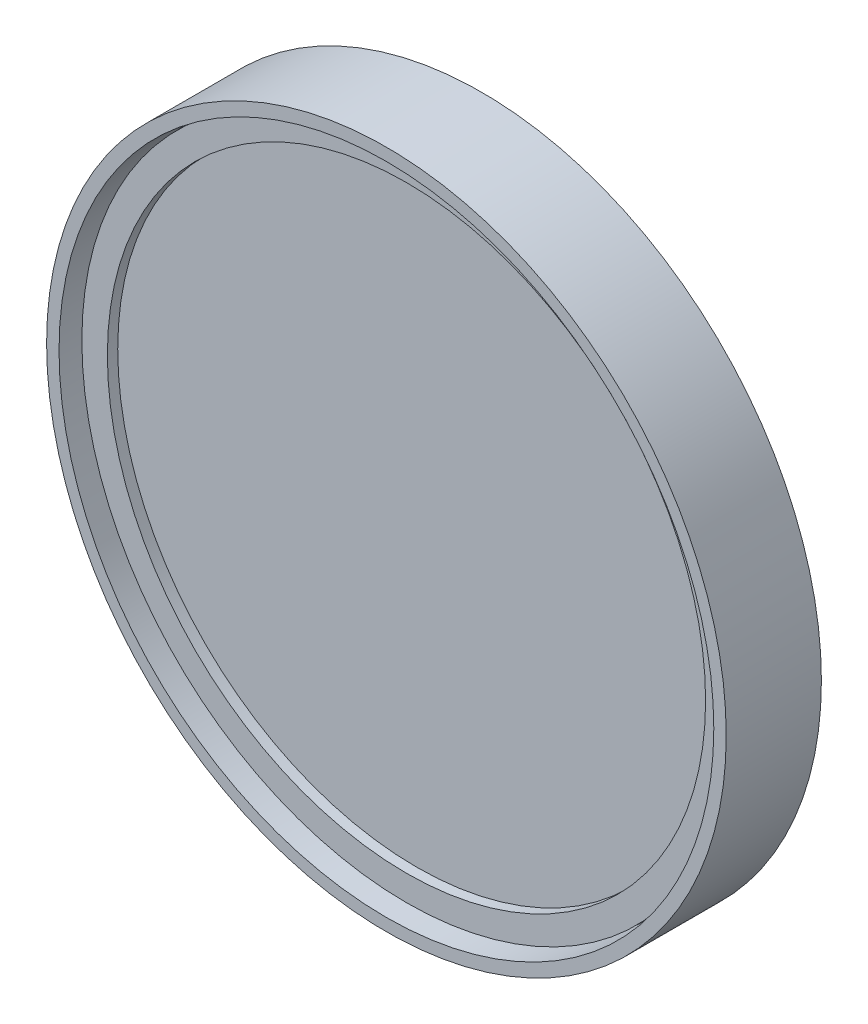
ISO-10303-21;
HEADER;
FILE_DESCRIPTION(('STEP AP214'),'2;1');
FILE_NAME('part.step','',(''),(''),'','','');
FILE_SCHEMA(('AUTOMOTIVE_DESIGN { 1 0 10303 214 1 1 1 1 }'));
ENDSEC;
DATA;
#1=APPLICATION_CONTEXT('core data for automotive mechanical design processes');
#2=APPLICATION_PROTOCOL_DEFINITION('international standard','automotive_design',2000,#1);
#3=PRODUCT_CONTEXT('',#1,'mechanical');
#4=PRODUCT('Part','Part','',(#3));
#5=PRODUCT_RELATED_PRODUCT_CATEGORY('part','',(#4));
#6=PRODUCT_DEFINITION_FORMATION('','',#4);
#7=PRODUCT_DEFINITION_CONTEXT('part definition',#1,'design');
#8=PRODUCT_DEFINITION('design','',#6,#7);
#9=PRODUCT_DEFINITION_SHAPE('','',#8);
#10=(LENGTH_UNIT() NAMED_UNIT(*) SI_UNIT(.MILLI.,.METRE.));
#11=(NAMED_UNIT(*) PLANE_ANGLE_UNIT() SI_UNIT($,.RADIAN.));
#12=(NAMED_UNIT(*) SI_UNIT($,.STERADIAN.) SOLID_ANGLE_UNIT());
#13=UNCERTAINTY_MEASURE_WITH_UNIT(LENGTH_MEASURE(1.E-05),#10,'distance_accuracy_value','');
#14=(GEOMETRIC_REPRESENTATION_CONTEXT(3) GLOBAL_UNCERTAINTY_ASSIGNED_CONTEXT((#13)) GLOBAL_UNIT_ASSIGNED_CONTEXT((#10,
#11,#12)) REPRESENTATION_CONTEXT('',''));
#15=CARTESIAN_POINT('',(0.,0.,0.));
#16=DIRECTION('',(0.,0.,1.));
#17=DIRECTION('',(1.,0.,0.));
#18=AXIS2_PLACEMENT_3D('',#15,#16,#17);
#19=CARTESIAN_POINT('',(0.,0.,2.381));
#20=DIRECTION('',(0.,0.,1.));
#21=DIRECTION('',(1.,0.,0.));
#22=AXIS2_PLACEMENT_3D('',#19,#20,#21);
#23=PLANE('',#22);
#24=CARTESIAN_POINT('',(0.,0.,2.381));
#25=DIRECTION('',(0.,0.,1.));
#26=DIRECTION('',(1.,0.,0.));
#27=AXIS2_PLACEMENT_3D('',#24,#25,#26);
#28=CIRCLE('',#27,11.95);
#29=CARTESIAN_POINT('',(11.95,0.,2.381));
#30=VERTEX_POINT('',#29);
#31=EDGE_CURVE('P0_E47',#30,#30,#28,.F.);
#32=ORIENTED_EDGE('',*,*,#31,.F.);
#33=EDGE_LOOP('',(#32));
#34=FACE_BOUND('',#33,.T.);
#35=ADVANCED_FACE('P0_F44',(#34),#23,.T.);
#36=CARTESIAN_POINT('',(0.,0.,0.381000000000001));
#37=DIRECTION('',(0.,0.,1.));
#38=DIRECTION('',(1.,0.,0.));
#39=AXIS2_PLACEMENT_3D('',#36,#37,#38);
#40=CYLINDRICAL_SURFACE('',#39,11.95);
#41=ORIENTED_EDGE('',*,*,#31,.T.);
#42=EDGE_LOOP('',(#41));
#43=FACE_BOUND('',#42,.T.);
#44=CARTESIAN_POINT('',(0.,0.,0.381000000000001));
#45=DIRECTION('',(0.,0.,1.));
#46=DIRECTION('',(1.,0.,0.));
#47=AXIS2_PLACEMENT_3D('',#44,#45,#46);
#48=CIRCLE('',#47,11.95);
#49=CARTESIAN_POINT('',(11.95,0.,0.381000000000001));
#50=VERTEX_POINT('',#49);
#51=EDGE_CURVE('P0_E11',#50,#50,#48,.T.);
#52=ORIENTED_EDGE('',*,*,#51,.T.);
#53=EDGE_LOOP('',(#52));
#54=FACE_BOUND('',#53,.T.);
#55=ADVANCED_FACE('P0_F73',(#43,#54),#40,.T.);
#56=CARTESIAN_POINT('',(0.,0.,0.381000000000001));
#57=DIRECTION('',(0.,0.,1.));
#58=DIRECTION('',(1.,0.,0.));
#59=AXIS2_PLACEMENT_3D('',#56,#57,#58);
#60=PLANE('',#59);
#61=CARTESIAN_POINT('',(0.,0.,0.381000000000001));
#62=DIRECTION('',(0.,0.,-1.));
#63=DIRECTION('',(-1.,0.,0.));
#64=AXIS2_PLACEMENT_3D('',#61,#62,#63);
#65=CIRCLE('',#64,11.);
#66=CARTESIAN_POINT('',(-11.,0.,0.381000000000001));
#67=VERTEX_POINT('',#66);
#68=EDGE_CURVE('P0_E56',#67,#67,#65,.T.);
#69=ORIENTED_EDGE('',*,*,#68,.F.);
#70=EDGE_LOOP('',(#69));
#71=FACE_BOUND('',#70,.T.);
#72=ORIENTED_EDGE('',*,*,#51,.F.);
#73=EDGE_LOOP('',(#72));
#74=FACE_BOUND('',#73,.T.);
#75=ADVANCED_FACE('P0_F67',(#71,#74),#60,.F.);
#76=CARTESIAN_POINT('',(0.,0.,0.761000000000001));
#77=DIRECTION('',(0.,0.,-1.));
#78=DIRECTION('',(-1.,0.,0.));
#79=AXIS2_PLACEMENT_3D('',#76,#77,#78);
#80=CYLINDRICAL_SURFACE('',#79,11.);
#81=CARTESIAN_POINT('',(0.,0.,0.761000000000001));
#82=DIRECTION('',(0.,0.,-1.));
#83=DIRECTION('',(-1.,0.,0.));
#84=AXIS2_PLACEMENT_3D('',#81,#82,#83);
#85=CIRCLE('',#84,11.);
#86=CARTESIAN_POINT('',(-11.,0.,0.761000000000001));
#87=VERTEX_POINT('',#86);
#88=EDGE_CURVE('P0_E54',#87,#87,#85,.T.);
#89=ORIENTED_EDGE('',*,*,#88,.F.);
#90=EDGE_LOOP('',(#89));
#91=FACE_BOUND('',#90,.T.);
#92=ORIENTED_EDGE('',*,*,#68,.T.);
#93=EDGE_LOOP('',(#92));
#94=FACE_BOUND('',#93,.T.);
#95=ADVANCED_FACE('P0_F64',(#91,#94),#80,.F.);
#96=CARTESIAN_POINT('',(0.,0.,0.761000000000001));
#97=DIRECTION('',(0.,0.,-1.));
#98=DIRECTION('',(-1.,0.,0.));
#99=AXIS2_PLACEMENT_3D('',#96,#97,#98);
#100=PLANE('',#99);
#101=ORIENTED_EDGE('',*,*,#88,.T.);
#102=EDGE_LOOP('',(#101));
#103=FACE_BOUND('',#102,.T.);
#104=ADVANCED_FACE('P0_F62',(#103),#100,.T.);
#105=CLOSED_SHELL('',(#35,#55,#75,#95,#104));
#106=MANIFOLD_SOLID_BREP('P0_B2',#105);
#107=CARTESIAN_POINT('',(0.,0.,2.762));
#108=DIRECTION('',(0.,0.,1.));
#109=DIRECTION('',(1.,0.,0.));
#110=AXIS2_PLACEMENT_3D('',#107,#108,#109);
#111=PLANE('',#110);
#112=CARTESIAN_POINT('',(0.,0.,2.762));
#113=DIRECTION('',(0.,0.,1.));
#114=DIRECTION('',(1.,0.,0.));
#115=AXIS2_PLACEMENT_3D('',#112,#113,#114);
#116=CIRCLE('',#115,11.);
#117=CARTESIAN_POINT('',(11.,0.,2.762));
#118=VERTEX_POINT('',#117);
#119=EDGE_CURVE('P0_E129',#118,#118,#116,.T.);
#120=ORIENTED_EDGE('',*,*,#119,.F.);
#121=EDGE_LOOP('',(#120));
#122=FACE_BOUND('',#121,.T.);
#123=CARTESIAN_POINT('',(0.,0.,2.762));
#124=DIRECTION('',(0.,0.,1.));
#125=DIRECTION('',(1.,0.,0.));
#126=AXIS2_PLACEMENT_3D('',#123,#124,#125);
#127=CIRCLE('',#126,11.938);
#128=CARTESIAN_POINT('',(11.938,0.,2.762));
#129=VERTEX_POINT('',#128);
#130=EDGE_CURVE('P0_E118',#129,#129,#127,.F.);
#131=ORIENTED_EDGE('',*,*,#130,.F.);
#132=EDGE_LOOP('',(#131));
#133=FACE_BOUND('',#132,.T.);
#134=ADVANCED_FACE('P0_F115',(#122,#133),#111,.T.);
#135=CARTESIAN_POINT('',(0.,0.,2.381));
#136=DIRECTION('',(0.,0.,1.));
#137=DIRECTION('',(1.,0.,0.));
#138=AXIS2_PLACEMENT_3D('',#135,#136,#137);
#139=CYLINDRICAL_SURFACE('',#138,11.938);
#140=ORIENTED_EDGE('',*,*,#130,.T.);
#141=EDGE_LOOP('',(#140));
#142=FACE_BOUND('',#141,.T.);
#143=CARTESIAN_POINT('',(0.,0.,2.381));
#144=DIRECTION('',(0.,0.,1.));
#145=DIRECTION('',(1.,0.,0.));
#146=AXIS2_PLACEMENT_3D('',#143,#144,#145);
#147=CIRCLE('',#146,11.938);
#148=CARTESIAN_POINT('',(11.938,0.,2.381));
#149=VERTEX_POINT('',#148);
#150=EDGE_CURVE('P0_E43',#149,#149,#147,.T.);
#151=ORIENTED_EDGE('',*,*,#150,.T.);
#152=EDGE_LOOP('',(#151));
#153=FACE_BOUND('',#152,.T.);
#154=ADVANCED_FACE('P0_F137',(#142,#153),#139,.T.);
#155=CARTESIAN_POINT('',(0.,0.,2.381));
#156=DIRECTION('',(0.,0.,1.));
#157=DIRECTION('',(1.,0.,0.));
#158=AXIS2_PLACEMENT_3D('',#155,#156,#157);
#159=PLANE('',#158);
#160=CARTESIAN_POINT('',(0.,0.,2.381));
#161=DIRECTION('',(0.,0.,1.));
#162=DIRECTION('',(1.,0.,0.));
#163=AXIS2_PLACEMENT_3D('',#160,#161,#162);
#164=CIRCLE('',#163,11.);
#165=CARTESIAN_POINT('',(11.,0.,2.381));
#166=VERTEX_POINT('',#165);
#167=EDGE_CURVE('P0_E125',#166,#166,#164,.F.);
#168=ORIENTED_EDGE('',*,*,#167,.F.);
#169=EDGE_LOOP('',(#168));
#170=FACE_BOUND('',#169,.T.);
#171=ORIENTED_EDGE('',*,*,#150,.F.);
#172=EDGE_LOOP('',(#171));
#173=FACE_BOUND('',#172,.T.);
#174=ADVANCED_FACE('P0_F141',(#170,#173),#159,.F.);
#175=CARTESIAN_POINT('',(0.,0.,-28.7316983722081));
#176=DIRECTION('',(0.,0.,1.));
#177=DIRECTION('',(1.,0.,0.));
#178=AXIS2_PLACEMENT_3D('',#175,#176,#177);
#179=CYLINDRICAL_SURFACE('',#178,11.);
#180=ORIENTED_EDGE('',*,*,#167,.T.);
#181=EDGE_LOOP('',(#180));
#182=FACE_BOUND('',#181,.T.);
#183=ORIENTED_EDGE('',*,*,#119,.T.);
#184=EDGE_LOOP('',(#183));
#185=FACE_BOUND('',#184,.T.);
#186=ADVANCED_FACE('P0_F133',(#182,#185),#179,.F.);
#187=CLOSED_SHELL('',(#134,#154,#174,#186));
#188=MANIFOLD_SOLID_BREP('P0_B6',#187);
#189=CARTESIAN_POINT('',(0.,0.,0.));
#190=DIRECTION('',(0.,0.,1.));
#191=DIRECTION('',(1.,0.,0.));
#192=AXIS2_PLACEMENT_3D('',#189,#190,#191);
#193=CYLINDRICAL_SURFACE('',#192,12.1031);
#194=CARTESIAN_POINT('',(0.,0.,0.6858));
#195=DIRECTION('',(0.,0.,1.));
#196=DIRECTION('',(1.,0.,0.));
#197=AXIS2_PLACEMENT_3D('',#194,#195,#196);
#198=CIRCLE('',#197,12.1031);
#199=CARTESIAN_POINT('',(12.1031,0.,0.6858));
#200=VERTEX_POINT('',#199);
#201=EDGE_CURVE('P1_E17',#200,#200,#198,.F.);
#202=ORIENTED_EDGE('',*,*,#201,.F.);
#203=EDGE_LOOP('',(#202));
#204=FACE_BOUND('',#203,.T.);
#205=CARTESIAN_POINT('',(0.,0.,0.381));
#206=DIRECTION('',(0.,0.,1.));
#207=DIRECTION('',(1.,0.,0.));
#208=AXIS2_PLACEMENT_3D('',#205,#206,#207);
#209=CIRCLE('',#208,12.1031);
#210=CARTESIAN_POINT('',(12.1031,0.,0.381));
#211=VERTEX_POINT('',#210);
#212=EDGE_CURVE('P1_E39',#211,#211,#209,.T.);
#213=ORIENTED_EDGE('',*,*,#212,.F.);
#214=EDGE_LOOP('',(#213));
#215=FACE_BOUND('',#214,.T.);
#216=ADVANCED_FACE('P1_F14',(#204,#215),#193,.F.);
#217=CARTESIAN_POINT('',(0.,12.0396,0.6858));
#218=DIRECTION('',(0.,0.,-1.));
#219=DIRECTION('',(-1.,0.,0.));
#220=AXIS2_PLACEMENT_3D('',#217,#218,#219);
#221=PLANE('',#220);
#222=ORIENTED_EDGE('',*,*,#201,.T.);
#223=EDGE_LOOP('',(#222));
#224=FACE_BOUND('',#223,.T.);
#225=CARTESIAN_POINT('',(0.,0.,0.6858));
#226=DIRECTION('',(0.,0.,-1.));
#227=DIRECTION('',(-1.,0.,0.));
#228=AXIS2_PLACEMENT_3D('',#225,#226,#227);
#229=CIRCLE('',#228,12.0396);
#230=CARTESIAN_POINT('',(-12.0396,0.,0.6858));
#231=VERTEX_POINT('',#230);
#232=EDGE_CURVE('P1_E37',#231,#231,#229,.F.);
#233=ORIENTED_EDGE('',*,*,#232,.T.);
#234=EDGE_LOOP('',(#233));
#235=FACE_BOUND('',#234,.T.);
#236=ADVANCED_FACE('P1_F46',(#224,#235),#221,.T.);
#237=CARTESIAN_POINT('',(0.,10.6045,0.381));
#238=DIRECTION('',(0.,0.,1.));
#239=DIRECTION('',(1.,0.,0.));
#240=AXIS2_PLACEMENT_3D('',#237,#238,#239);
#241=PLANE('',#240);
#242=ORIENTED_EDGE('',*,*,#212,.T.);
#243=EDGE_LOOP('',(#242));
#244=FACE_BOUND('',#243,.T.);
#245=CARTESIAN_POINT('',(0.,0.,0.381));
#246=DIRECTION('',(0.,0.,-1.));
#247=DIRECTION('',(-1.,0.,0.));
#248=AXIS2_PLACEMENT_3D('',#245,#246,#247);
#249=CIRCLE('',#248,10.6045);
#250=CARTESIAN_POINT('',(-10.6045,0.,0.381));
#251=VERTEX_POINT('',#250);
#252=EDGE_CURVE('P1_E34',#251,#251,#249,.T.);
#253=ORIENTED_EDGE('',*,*,#252,.T.);
#254=EDGE_LOOP('',(#253));
#255=FACE_BOUND('',#254,.T.);
#256=ADVANCED_FACE('P1_F55',(#244,#255),#241,.T.);
#257=CARTESIAN_POINT('',(0.,0.,0.));
#258=DIRECTION('',(0.,0.,-1.));
#259=DIRECTION('',(-1.,0.,0.));
#260=AXIS2_PLACEMENT_3D('',#257,#258,#259);
#261=CYLINDRICAL_SURFACE('',#260,12.0396);
#262=ORIENTED_EDGE('',*,*,#232,.F.);
#263=EDGE_LOOP('',(#262));
#264=FACE_BOUND('',#263,.T.);
#265=CARTESIAN_POINT('',(0.,0.,3.5));
#266=DIRECTION('',(0.,0.,-1.));
#267=DIRECTION('',(-1.,0.,0.));
#268=AXIS2_PLACEMENT_3D('',#265,#266,#267);
#269=CIRCLE('',#268,12.0396);
#270=CARTESIAN_POINT('',(-12.0396,0.,3.5));
#271=VERTEX_POINT('',#270);
#272=EDGE_CURVE('P1_E31',#271,#271,#269,.T.);
#273=ORIENTED_EDGE('',*,*,#272,.F.);
#274=EDGE_LOOP('',(#273));
#275=FACE_BOUND('',#274,.T.);
#276=ADVANCED_FACE('P1_F74',(#264,#275),#261,.F.);
#277=CARTESIAN_POINT('',(0.,0.,0.));
#278=DIRECTION('',(0.,0.,-1.));
#279=DIRECTION('',(-1.,0.,0.));
#280=AXIS2_PLACEMENT_3D('',#277,#278,#279);
#281=CYLINDRICAL_SURFACE('',#280,10.6045);
#282=CARTESIAN_POINT('',(0.,0.,0.));
#283=DIRECTION('',(0.,0.,-1.));
#284=DIRECTION('',(-1.,0.,0.));
#285=AXIS2_PLACEMENT_3D('',#282,#283,#284);
#286=CIRCLE('',#285,10.6045);
#287=CARTESIAN_POINT('',(-10.6045,0.,0.));
#288=VERTEX_POINT('',#287);
#289=EDGE_CURVE('P1_E26',#288,#288,#286,.F.);
#290=ORIENTED_EDGE('',*,*,#289,.F.);
#291=EDGE_LOOP('',(#290));
#292=FACE_BOUND('',#291,.T.);
#293=ORIENTED_EDGE('',*,*,#252,.F.);
#294=EDGE_LOOP('',(#293));
#295=FACE_BOUND('',#294,.T.);
#296=ADVANCED_FACE('P1_F70',(#292,#295),#281,.F.);
#297=CARTESIAN_POINT('',(0.,12.0396,3.5));
#298=DIRECTION('',(0.,0.,1.));
#299=DIRECTION('',(1.,0.,0.));
#300=AXIS2_PLACEMENT_3D('',#297,#298,#299);
#301=PLANE('',#300);
#302=CARTESIAN_POINT('',(0.,0.,3.5));
#303=DIRECTION('',(0.,0.,-1.));
#304=DIRECTION('',(-1.,0.,0.));
#305=AXIS2_PLACEMENT_3D('',#302,#303,#304);
#306=CIRCLE('',#305,12.4968);
#307=CARTESIAN_POINT('',(-12.4968,0.,3.5));
#308=VERTEX_POINT('',#307);
#309=EDGE_CURVE('P1_E21',#308,#308,#306,.T.);
#310=ORIENTED_EDGE('',*,*,#309,.F.);
#311=EDGE_LOOP('',(#310));
#312=FACE_BOUND('',#311,.T.);
#313=ORIENTED_EDGE('',*,*,#272,.T.);
#314=EDGE_LOOP('',(#313));
#315=FACE_BOUND('',#314,.T.);
#316=ADVANCED_FACE('P1_F63',(#312,#315),#301,.T.);
#317=CARTESIAN_POINT('',(0.,10.6045,0.));
#318=DIRECTION('',(0.,0.,-1.));
#319=DIRECTION('',(-1.,0.,0.));
#320=AXIS2_PLACEMENT_3D('',#317,#318,#319);
#321=PLANE('',#320);
#322=ORIENTED_EDGE('',*,*,#289,.T.);
#323=EDGE_LOOP('',(#322));
#324=FACE_BOUND('',#323,.T.);
#325=CARTESIAN_POINT('',(0.,0.,0.));
#326=DIRECTION('',(0.,0.,-1.));
#327=DIRECTION('',(-1.,0.,0.));
#328=AXIS2_PLACEMENT_3D('',#325,#326,#327);
#329=CIRCLE('',#328,12.4968);
#330=CARTESIAN_POINT('',(-12.4968,0.,0.));
#331=VERTEX_POINT('',#330);
#332=EDGE_CURVE('P1_E10',#331,#331,#329,.F.);
#333=ORIENTED_EDGE('',*,*,#332,.F.);
#334=EDGE_LOOP('',(#333));
#335=FACE_BOUND('',#334,.T.);
#336=ADVANCED_FACE('P1_F58',(#324,#335),#321,.T.);
#337=CARTESIAN_POINT('',(0.,0.,0.));
#338=DIRECTION('',(0.,0.,-1.));
#339=DIRECTION('',(-1.,0.,0.));
#340=AXIS2_PLACEMENT_3D('',#337,#338,#339);
#341=CYLINDRICAL_SURFACE('',#340,12.4968);
#342=ORIENTED_EDGE('',*,*,#332,.T.);
#343=EDGE_LOOP('',(#342));
#344=FACE_BOUND('',#343,.T.);
#345=ORIENTED_EDGE('',*,*,#309,.T.);
#346=EDGE_LOOP('',(#345));
#347=FACE_BOUND('',#346,.T.);
#348=ADVANCED_FACE('P1_F56',(#344,#347),#341,.T.);
#349=CLOSED_SHELL('',(#216,#236,#256,#276,#296,#316,#336,#348));
#350=MANIFOLD_SOLID_BREP('P1_B1',#349);
#351=ADVANCED_BREP_SHAPE_REPRESENTATION('',(#18,#106,#188,#350),#14);
#352=SHAPE_DEFINITION_REPRESENTATION(#9,#351);
ENDSEC;
END-ISO-10303-21;
